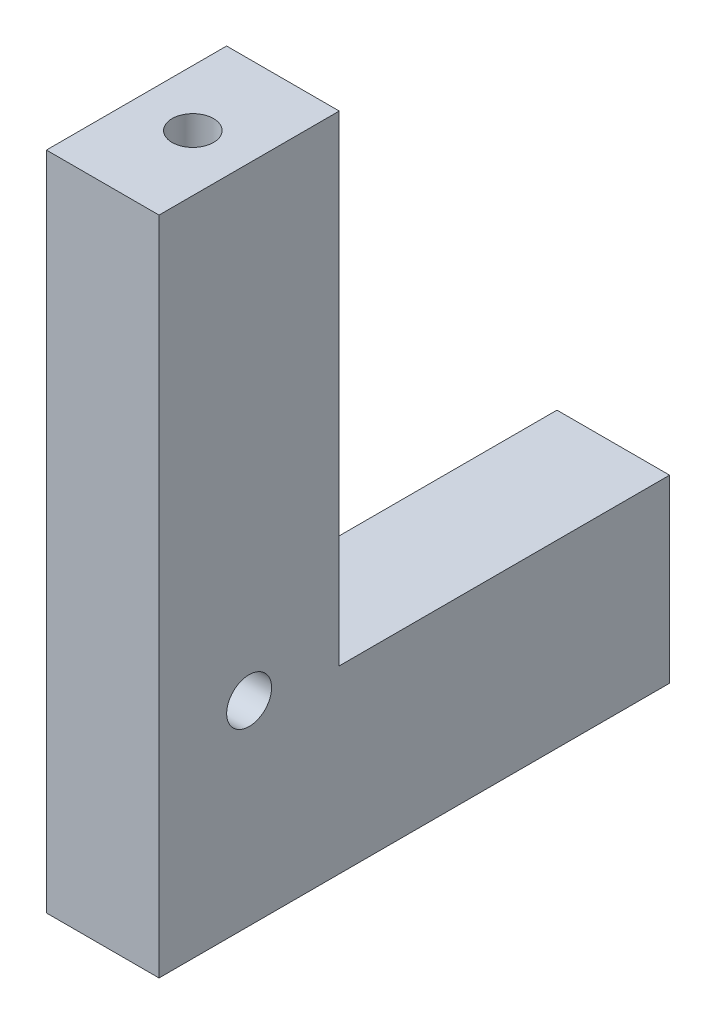
ISO-10303-21;
HEADER;
FILE_DESCRIPTION(('STEP AP214'),'2;1');
FILE_NAME('part.step','',(''),(''),'','','');
FILE_SCHEMA(('AUTOMOTIVE_DESIGN { 1 0 10303 214 1 1 1 1 }'));
ENDSEC;
DATA;
#1=APPLICATION_CONTEXT('core data for automotive mechanical design processes');
#2=APPLICATION_PROTOCOL_DEFINITION('international standard','automotive_design',2000,#1);
#3=PRODUCT_CONTEXT('',#1,'mechanical');
#4=PRODUCT('Part','Part','',(#3));
#5=PRODUCT_RELATED_PRODUCT_CATEGORY('part','',(#4));
#6=PRODUCT_DEFINITION_FORMATION('','',#4);
#7=PRODUCT_DEFINITION_CONTEXT('part definition',#1,'design');
#8=PRODUCT_DEFINITION('design','',#6,#7);
#9=PRODUCT_DEFINITION_SHAPE('','',#8);
#10=(LENGTH_UNIT() NAMED_UNIT(*) SI_UNIT(.MILLI.,.METRE.));
#11=(NAMED_UNIT(*) PLANE_ANGLE_UNIT() SI_UNIT($,.RADIAN.));
#12=(NAMED_UNIT(*) SI_UNIT($,.STERADIAN.) SOLID_ANGLE_UNIT());
#13=UNCERTAINTY_MEASURE_WITH_UNIT(LENGTH_MEASURE(1.E-05),#10,'distance_accuracy_value','');
#14=(GEOMETRIC_REPRESENTATION_CONTEXT(3) GLOBAL_UNCERTAINTY_ASSIGNED_CONTEXT((#13)) GLOBAL_UNIT_ASSIGNED_CONTEXT((#10,
#11,#12)) REPRESENTATION_CONTEXT('',''));
#15=CARTESIAN_POINT('',(0.,0.,0.));
#16=DIRECTION('',(0.,0.,1.));
#17=DIRECTION('',(1.,0.,0.));
#18=AXIS2_PLACEMENT_3D('',#15,#16,#17);
#19=CARTESIAN_POINT('',(0.,0.,0.));
#20=DIRECTION('',(0.,0.,1.));
#21=DIRECTION('',(1.,0.,0.));
#22=AXIS2_PLACEMENT_3D('',#19,#20,#21);
#23=PLANE('',#22);
#24=DIRECTION('',(0.,1.,0.));
#25=VECTOR('',#24,1.);
#26=CARTESIAN_POINT('',(0.,0.,0.));
#27=LINE('',#26,#25);
#28=CARTESIAN_POINT('',(0.,0.,0.));
#29=VERTEX_POINT('',#28);
#30=CARTESIAN_POINT('',(0.,15.24,0.));
#31=VERTEX_POINT('',#30);
#32=EDGE_CURVE('E91',#29,#31,#27,.T.);
#33=ORIENTED_EDGE('',*,*,#32,.F.);
#34=DIRECTION('',(1.,0.,0.));
#35=VECTOR('',#34,1.);
#36=CARTESIAN_POINT('',(0.,0.,0.));
#37=LINE('',#36,#35);
#38=CARTESIAN_POINT('',(-9.525,0.,0.));
#39=VERTEX_POINT('',#38);
#40=EDGE_CURVE('E76',#39,#29,#37,.T.);
#41=ORIENTED_EDGE('',*,*,#40,.F.);
#42=DIRECTION('',(0.,-1.,0.));
#43=VECTOR('',#42,1.);
#44=CARTESIAN_POINT('',(-9.525,0.,0.));
#45=LINE('',#44,#43);
#46=CARTESIAN_POINT('',(-9.525,15.24,0.));
#47=VERTEX_POINT('',#46);
#48=EDGE_CURVE('E87',#47,#39,#45,.T.);
#49=ORIENTED_EDGE('',*,*,#48,.F.);
#50=DIRECTION('',(-1.,0.,0.));
#51=VECTOR('',#50,1.);
#52=CARTESIAN_POINT('',(0.,15.24,0.));
#53=LINE('',#52,#51);
#54=EDGE_CURVE('E97',#31,#47,#53,.T.);
#55=ORIENTED_EDGE('',*,*,#54,.F.);
#56=EDGE_LOOP('',(#33,#41,#49,#55));
#57=FACE_BOUND('',#56,.T.);
#58=CARTESIAN_POINT('',(-4.7625,3.81,0.));
#59=DIRECTION('',(0.,0.,-1.));
#60=DIRECTION('',(-1.,0.,0.));
#61=AXIS2_PLACEMENT_3D('',#58,#59,#60);
#62=CIRCLE('',#61,1.7526);
#63=CARTESIAN_POINT('',(-6.5151,3.81,0.));
#64=VERTEX_POINT('',#63);
#65=EDGE_CURVE('E116',#64,#64,#62,.T.);
#66=ORIENTED_EDGE('',*,*,#65,.F.);
#67=EDGE_LOOP('',(#66));
#68=FACE_BOUND('',#67,.T.);
#69=CARTESIAN_POINT('',(-4.7625,11.43,0.));
#70=DIRECTION('',(0.,0.,-1.));
#71=DIRECTION('',(-1.,0.,0.));
#72=AXIS2_PLACEMENT_3D('',#69,#70,#71);
#73=CIRCLE('',#72,1.7526);
#74=CARTESIAN_POINT('',(-6.5151,11.43,0.));
#75=VERTEX_POINT('',#74);
#76=EDGE_CURVE('E163',#75,#75,#73,.T.);
#77=ORIENTED_EDGE('',*,*,#76,.F.);
#78=EDGE_LOOP('',(#77));
#79=FACE_BOUND('',#78,.T.);
#80=ADVANCED_FACE('F33',(#57,#68,#79),#23,.F.);
#81=CARTESIAN_POINT('',(0.,15.24,43.18));
#82=DIRECTION('',(0.,-1.,0.));
#83=DIRECTION('',(1.,0.,0.));
#84=AXIS2_PLACEMENT_3D('',#81,#82,#83);
#85=PLANE('',#84);
#86=DIRECTION('',(-1.,0.,0.));
#87=VECTOR('',#86,1.);
#88=CARTESIAN_POINT('',(-9.525,15.24,27.94));
#89=LINE('',#88,#87);
#90=CARTESIAN_POINT('',(0.,15.24,27.94));
#91=VERTEX_POINT('',#90);
#92=CARTESIAN_POINT('',(-9.525,15.24,27.94));
#93=VERTEX_POINT('',#92);
#94=EDGE_CURVE('E49',#91,#93,#89,.T.);
#95=ORIENTED_EDGE('',*,*,#94,.F.);
#96=DIRECTION('',(0.,0.,-1.));
#97=VECTOR('',#96,1.);
#98=CARTESIAN_POINT('',(0.,15.24,43.18));
#99=LINE('',#98,#97);
#100=EDGE_CURVE('E11',#91,#31,#99,.T.);
#101=ORIENTED_EDGE('',*,*,#100,.T.);
#102=ORIENTED_EDGE('',*,*,#54,.T.);
#103=DIRECTION('',(0.,0.,-1.));
#104=VECTOR('',#103,1.);
#105=CARTESIAN_POINT('',(-9.525,15.24,43.18));
#106=LINE('',#105,#104);
#107=EDGE_CURVE('E42',#93,#47,#106,.T.);
#108=ORIENTED_EDGE('',*,*,#107,.F.);
#109=EDGE_LOOP('',(#95,#101,#102,#108));
#110=FACE_BOUND('',#109,.T.);
#111=ADVANCED_FACE('F137',(#110),#85,.F.);
#112=CARTESIAN_POINT('',(0.,0.,43.18));
#113=DIRECTION('',(-1.,0.,0.));
#114=DIRECTION('',(0.,-1.,0.));
#115=AXIS2_PLACEMENT_3D('',#112,#113,#114);
#116=PLANE('',#115);
#117=CARTESIAN_POINT('',(0.,16.51,35.56));
#118=DIRECTION('',(1.,0.,0.));
#119=DIRECTION('',(0.,0.,-1.));
#120=AXIS2_PLACEMENT_3D('',#117,#118,#119);
#121=CIRCLE('',#120,1.89865);
#122=CARTESIAN_POINT('',(0.,16.51,33.66135));
#123=VERTEX_POINT('',#122);
#124=EDGE_CURVE('E178',#123,#123,#121,.T.);
#125=ORIENTED_EDGE('',*,*,#124,.F.);
#126=EDGE_LOOP('',(#125));
#127=FACE_BOUND('',#126,.T.);
#128=ORIENTED_EDGE('',*,*,#32,.T.);
#129=ORIENTED_EDGE('',*,*,#100,.F.);
#130=DIRECTION('',(0.,-1.,0.));
#131=VECTOR('',#130,1.);
#132=CARTESIAN_POINT('',(0.,55.88,27.94));
#133=LINE('',#132,#131);
#134=CARTESIAN_POINT('',(0.,55.88,27.94));
#135=VERTEX_POINT('',#134);
#136=EDGE_CURVE('E98',#135,#91,#133,.T.);
#137=ORIENTED_EDGE('',*,*,#136,.F.);
#138=DIRECTION('',(0.,0.,-1.));
#139=VECTOR('',#138,1.);
#140=CARTESIAN_POINT('',(0.,55.88,43.18));
#141=LINE('',#140,#139);
#142=CARTESIAN_POINT('',(0.,55.88,43.18));
#143=VERTEX_POINT('',#142);
#144=EDGE_CURVE('E148',#143,#135,#141,.T.);
#145=ORIENTED_EDGE('',*,*,#144,.F.);
#146=DIRECTION('',(0.,1.,0.));
#147=VECTOR('',#146,1.);
#148=CARTESIAN_POINT('',(0.,0.,43.18));
#149=LINE('',#148,#147);
#150=CARTESIAN_POINT('',(0.,0.,43.18));
#151=VERTEX_POINT('',#150);
#152=EDGE_CURVE('E86',#151,#143,#149,.T.);
#153=ORIENTED_EDGE('',*,*,#152,.F.);
#154=DIRECTION('',(0.,0.,-1.));
#155=VECTOR('',#154,1.);
#156=CARTESIAN_POINT('',(0.,0.,43.18));
#157=LINE('',#156,#155);
#158=EDGE_CURVE('E79',#151,#29,#157,.T.);
#159=ORIENTED_EDGE('',*,*,#158,.T.);
#160=EDGE_LOOP('',(#128,#129,#137,#145,#153,#159));
#161=FACE_BOUND('',#160,.T.);
#162=ADVANCED_FACE('F35',(#127,#161),#116,.F.);
#163=CARTESIAN_POINT('',(-9.525,0.,43.18));
#164=DIRECTION('',(1.,0.,0.));
#165=DIRECTION('',(0.,0.,-1.));
#166=AXIS2_PLACEMENT_3D('',#163,#164,#165);
#167=PLANE('',#166);
#168=CARTESIAN_POINT('',(-9.525,16.51,35.56));
#169=DIRECTION('',(1.,0.,0.));
#170=DIRECTION('',(0.,0.,-1.));
#171=AXIS2_PLACEMENT_3D('',#168,#169,#170);
#172=CIRCLE('',#171,1.89865);
#173=CARTESIAN_POINT('',(-9.525,16.51,33.66135));
#174=VERTEX_POINT('',#173);
#175=EDGE_CURVE('E175',#174,#174,#172,.T.);
#176=ORIENTED_EDGE('',*,*,#175,.T.);
#177=EDGE_LOOP('',(#176));
#178=FACE_BOUND('',#177,.T.);
#179=ORIENTED_EDGE('',*,*,#48,.T.);
#180=DIRECTION('',(0.,0.,-1.));
#181=VECTOR('',#180,1.);
#182=CARTESIAN_POINT('',(-9.525,0.,43.18));
#183=LINE('',#182,#181);
#184=CARTESIAN_POINT('',(-9.525,0.,43.18));
#185=VERTEX_POINT('',#184);
#186=EDGE_CURVE('E82',#185,#39,#183,.T.);
#187=ORIENTED_EDGE('',*,*,#186,.F.);
#188=DIRECTION('',(0.,-1.,0.));
#189=VECTOR('',#188,1.);
#190=CARTESIAN_POINT('',(-9.525,0.,43.18));
#191=LINE('',#190,#189);
#192=CARTESIAN_POINT('',(-9.52500000000006,55.88,43.18));
#193=VERTEX_POINT('',#192);
#194=EDGE_CURVE('E123',#193,#185,#191,.T.);
#195=ORIENTED_EDGE('',*,*,#194,.F.);
#196=DIRECTION('',(0.,0.,1.));
#197=VECTOR('',#196,1.);
#198=CARTESIAN_POINT('',(-9.52500000000006,55.88,43.18));
#199=LINE('',#198,#197);
#200=CARTESIAN_POINT('',(-9.52500000000006,55.88,27.94));
#201=VERTEX_POINT('',#200);
#202=EDGE_CURVE('E115',#201,#193,#199,.T.);
#203=ORIENTED_EDGE('',*,*,#202,.F.);
#204=DIRECTION('',(0.,-1.,0.));
#205=VECTOR('',#204,1.);
#206=CARTESIAN_POINT('',(-9.52500000000006,55.88,27.94));
#207=LINE('',#206,#205);
#208=EDGE_CURVE('E102',#201,#93,#207,.T.);
#209=ORIENTED_EDGE('',*,*,#208,.T.);
#210=ORIENTED_EDGE('',*,*,#107,.T.);
#211=EDGE_LOOP('',(#179,#187,#195,#203,#209,#210));
#212=FACE_BOUND('',#211,.T.);
#213=ADVANCED_FACE('F133',(#178,#212),#167,.F.);
#214=CARTESIAN_POINT('',(0.,0.,43.18));
#215=DIRECTION('',(0.,1.,0.));
#216=DIRECTION('',(-1.,0.,0.));
#217=AXIS2_PLACEMENT_3D('',#214,#215,#216);
#218=PLANE('',#217);
#219=ORIENTED_EDGE('',*,*,#40,.T.);
#220=ORIENTED_EDGE('',*,*,#158,.F.);
#221=DIRECTION('',(1.,0.,0.));
#222=VECTOR('',#221,1.);
#223=CARTESIAN_POINT('',(0.,0.,43.18));
#224=LINE('',#223,#222);
#225=EDGE_CURVE('E58',#185,#151,#224,.T.);
#226=ORIENTED_EDGE('',*,*,#225,.F.);
#227=ORIENTED_EDGE('',*,*,#186,.T.);
#228=EDGE_LOOP('',(#219,#220,#226,#227));
#229=FACE_BOUND('',#228,.T.);
#230=ADVANCED_FACE('F78',(#229),#218,.F.);
#231=CARTESIAN_POINT('',(0.,0.,43.18));
#232=DIRECTION('',(0.,0.,1.));
#233=DIRECTION('',(1.,0.,0.));
#234=AXIS2_PLACEMENT_3D('',#231,#232,#233);
#235=PLANE('',#234);
#236=ORIENTED_EDGE('',*,*,#152,.T.);
#237=DIRECTION('',(1.,0.,0.));
#238=VECTOR('',#237,1.);
#239=CARTESIAN_POINT('',(-9.52500000000006,55.88,43.18));
#240=LINE('',#239,#238);
#241=EDGE_CURVE('E129',#193,#143,#240,.T.);
#242=ORIENTED_EDGE('',*,*,#241,.F.);
#243=ORIENTED_EDGE('',*,*,#194,.T.);
#244=ORIENTED_EDGE('',*,*,#225,.T.);
#245=EDGE_LOOP('',(#236,#242,#243,#244));
#246=FACE_BOUND('',#245,.T.);
#247=ADVANCED_FACE('F126',(#246),#235,.T.);
#248=CARTESIAN_POINT('',(-9.52500000000006,55.88,27.94));
#249=DIRECTION('',(0.,0.,1.));
#250=DIRECTION('',(1.,0.,0.));
#251=AXIS2_PLACEMENT_3D('',#248,#249,#250);
#252=PLANE('',#251);
#253=ORIENTED_EDGE('',*,*,#94,.T.);
#254=ORIENTED_EDGE('',*,*,#208,.F.);
#255=DIRECTION('',(-1.,0.,0.));
#256=VECTOR('',#255,1.);
#257=CARTESIAN_POINT('',(-9.52500000000006,55.88,27.94));
#258=LINE('',#257,#256);
#259=EDGE_CURVE('E121',#135,#201,#258,.T.);
#260=ORIENTED_EDGE('',*,*,#259,.F.);
#261=ORIENTED_EDGE('',*,*,#136,.T.);
#262=EDGE_LOOP('',(#253,#254,#260,#261));
#263=FACE_BOUND('',#262,.T.);
#264=ADVANCED_FACE('F142',(#263),#252,.F.);
#265=CARTESIAN_POINT('',(-9.52500000000006,55.88,27.94));
#266=DIRECTION('',(0.,-1.,0.));
#267=DIRECTION('',(1.,0.,0.));
#268=AXIS2_PLACEMENT_3D('',#265,#266,#267);
#269=PLANE('',#268);
#270=CARTESIAN_POINT('',(-4.76250000000006,55.88,35.56));
#271=DIRECTION('',(0.,1.,0.));
#272=DIRECTION('',(0.,0.,1.));
#273=AXIS2_PLACEMENT_3D('',#270,#271,#272);
#274=CIRCLE('',#273,1.7526);
#275=CARTESIAN_POINT('',(-4.76250000000006,55.88,37.3126));
#276=VERTEX_POINT('',#275);
#277=EDGE_CURVE('E181',#276,#276,#274,.T.);
#278=ORIENTED_EDGE('',*,*,#277,.F.);
#279=EDGE_LOOP('',(#278));
#280=FACE_BOUND('',#279,.T.);
#281=ORIENTED_EDGE('',*,*,#202,.T.);
#282=ORIENTED_EDGE('',*,*,#241,.T.);
#283=ORIENTED_EDGE('',*,*,#144,.T.);
#284=ORIENTED_EDGE('',*,*,#259,.T.);
#285=EDGE_LOOP('',(#281,#282,#283,#284));
#286=FACE_BOUND('',#285,.T.);
#287=ADVANCED_FACE('F215',(#280,#286),#269,.F.);
#288=CARTESIAN_POINT('',(-4.7625,3.81,0.));
#289=DIRECTION('',(0.,0.,-1.));
#290=DIRECTION('',(-1.,0.,0.));
#291=AXIS2_PLACEMENT_3D('',#288,#289,#290);
#292=CYLINDRICAL_SURFACE('',#291,1.7526);
#293=CARTESIAN_POINT('',(-4.7625,3.81,9.906));
#294=DIRECTION('',(0.,0.,-1.));
#295=DIRECTION('',(-1.,0.,0.));
#296=AXIS2_PLACEMENT_3D('',#293,#294,#295);
#297=CIRCLE('',#296,1.7526);
#298=CARTESIAN_POINT('',(-6.5151,3.81,9.906));
#299=VERTEX_POINT('',#298);
#300=EDGE_CURVE('E154',#299,#299,#297,.T.);
#301=ORIENTED_EDGE('',*,*,#300,.F.);
#302=EDGE_LOOP('',(#301));
#303=FACE_BOUND('',#302,.T.);
#304=ORIENTED_EDGE('',*,*,#65,.T.);
#305=EDGE_LOOP('',(#304));
#306=FACE_BOUND('',#305,.T.);
#307=ADVANCED_FACE('F217',(#303,#306),#292,.F.);
#308=CARTESIAN_POINT('',(-3.40995000000001,3.81,9.906));
#309=DIRECTION('',(0.,0.,1.));
#310=DIRECTION('',(1.,0.,0.));
#311=AXIS2_PLACEMENT_3D('',#308,#309,#310);
#312=PLANE('',#311);
#313=CARTESIAN_POINT('',(-4.7625,3.81,9.906));
#314=DIRECTION('',(0.,0.,-1.));
#315=DIRECTION('',(-1.,0.,0.));
#316=AXIS2_PLACEMENT_3D('',#313,#314,#315);
#317=CIRCLE('',#316,1.35255);
#318=CARTESIAN_POINT('',(-6.11505,3.81,9.906));
#319=VERTEX_POINT('',#318);
#320=EDGE_CURVE('E157',#319,#319,#317,.T.);
#321=ORIENTED_EDGE('',*,*,#320,.F.);
#322=EDGE_LOOP('',(#321));
#323=FACE_BOUND('',#322,.T.);
#324=ORIENTED_EDGE('',*,*,#300,.T.);
#325=EDGE_LOOP('',(#324));
#326=FACE_BOUND('',#325,.T.);
#327=ADVANCED_FACE('F283',(#323,#326),#312,.F.);
#328=CARTESIAN_POINT('',(-4.7625,3.81,0.));
#329=DIRECTION('',(0.,0.,-1.));
#330=DIRECTION('',(-1.,0.,0.));
#331=AXIS2_PLACEMENT_3D('',#328,#329,#330);
#332=CYLINDRICAL_SURFACE('',#331,1.35255);
#333=CARTESIAN_POINT('',(-4.7625,3.81,13.97));
#334=DIRECTION('',(0.,0.,-1.));
#335=DIRECTION('',(-1.,0.,0.));
#336=AXIS2_PLACEMENT_3D('',#333,#334,#335);
#337=CIRCLE('',#336,1.35255);
#338=CARTESIAN_POINT('',(-6.11505,3.81,13.97));
#339=VERTEX_POINT('',#338);
#340=EDGE_CURVE('E160',#339,#339,#337,.T.);
#341=ORIENTED_EDGE('',*,*,#340,.F.);
#342=EDGE_LOOP('',(#341));
#343=FACE_BOUND('',#342,.T.);
#344=ORIENTED_EDGE('',*,*,#320,.T.);
#345=EDGE_LOOP('',(#344));
#346=FACE_BOUND('',#345,.T.);
#347=ADVANCED_FACE('F280',(#343,#346),#332,.F.);
#348=CARTESIAN_POINT('',(-4.7625,3.81,13.97));
#349=DIRECTION('',(0.,0.,-1.));
#350=DIRECTION('',(-1.,0.,0.));
#351=AXIS2_PLACEMENT_3D('',#348,#349,#350);
#352=CONICAL_SURFACE('',#351,1.35255,1.02974425867665);
#353=CARTESIAN_POINT('',(-4.76250000000001,3.81,14.7826940302657));
#354=VERTEX_POINT('',#353);
#355=VERTEX_LOOP('',#354);
#356=FACE_BOUND('',#355,.T.);
#357=ORIENTED_EDGE('',*,*,#340,.T.);
#358=EDGE_LOOP('',(#357));
#359=FACE_BOUND('',#358,.T.);
#360=ADVANCED_FACE('F276',(#356,#359),#352,.F.);
#361=CARTESIAN_POINT('',(-4.7625,11.43,0.));
#362=DIRECTION('',(0.,0.,-1.));
#363=DIRECTION('',(-1.,0.,0.));
#364=AXIS2_PLACEMENT_3D('',#361,#362,#363);
#365=CYLINDRICAL_SURFACE('',#364,1.7526);
#366=CARTESIAN_POINT('',(-4.7625,11.43,9.906));
#367=DIRECTION('',(0.,0.,-1.));
#368=DIRECTION('',(-1.,0.,0.));
#369=AXIS2_PLACEMENT_3D('',#366,#367,#368);
#370=CIRCLE('',#369,1.7526);
#371=CARTESIAN_POINT('',(-6.5151,11.43,9.906));
#372=VERTEX_POINT('',#371);
#373=EDGE_CURVE('E166',#372,#372,#370,.T.);
#374=ORIENTED_EDGE('',*,*,#373,.F.);
#375=EDGE_LOOP('',(#374));
#376=FACE_BOUND('',#375,.T.);
#377=ORIENTED_EDGE('',*,*,#76,.T.);
#378=EDGE_LOOP('',(#377));
#379=FACE_BOUND('',#378,.T.);
#380=ADVANCED_FACE('F272',(#376,#379),#365,.F.);
#381=CARTESIAN_POINT('',(-3.40995000000001,11.43,9.906));
#382=DIRECTION('',(0.,0.,1.));
#383=DIRECTION('',(1.,0.,0.));
#384=AXIS2_PLACEMENT_3D('',#381,#382,#383);
#385=PLANE('',#384);
#386=CARTESIAN_POINT('',(-4.7625,11.43,9.906));
#387=DIRECTION('',(0.,0.,-1.));
#388=DIRECTION('',(-1.,0.,0.));
#389=AXIS2_PLACEMENT_3D('',#386,#387,#388);
#390=CIRCLE('',#389,1.35255);
#391=CARTESIAN_POINT('',(-6.11505,11.43,9.906));
#392=VERTEX_POINT('',#391);
#393=EDGE_CURVE('E169',#392,#392,#390,.T.);
#394=ORIENTED_EDGE('',*,*,#393,.F.);
#395=EDGE_LOOP('',(#394));
#396=FACE_BOUND('',#395,.T.);
#397=ORIENTED_EDGE('',*,*,#373,.T.);
#398=EDGE_LOOP('',(#397));
#399=FACE_BOUND('',#398,.T.);
#400=ADVANCED_FACE('F268',(#396,#399),#385,.F.);
#401=CARTESIAN_POINT('',(-4.7625,11.43,0.));
#402=DIRECTION('',(0.,0.,-1.));
#403=DIRECTION('',(-1.,0.,0.));
#404=AXIS2_PLACEMENT_3D('',#401,#402,#403);
#405=CYLINDRICAL_SURFACE('',#404,1.35255);
#406=CARTESIAN_POINT('',(-4.7625,11.43,13.97));
#407=DIRECTION('',(0.,0.,-1.));
#408=DIRECTION('',(-1.,0.,0.));
#409=AXIS2_PLACEMENT_3D('',#406,#407,#408);
#410=CIRCLE('',#409,1.35255);
#411=CARTESIAN_POINT('',(-6.11505,11.43,13.97));
#412=VERTEX_POINT('',#411);
#413=EDGE_CURVE('E172',#412,#412,#410,.T.);
#414=ORIENTED_EDGE('',*,*,#413,.F.);
#415=EDGE_LOOP('',(#414));
#416=FACE_BOUND('',#415,.T.);
#417=ORIENTED_EDGE('',*,*,#393,.T.);
#418=EDGE_LOOP('',(#417));
#419=FACE_BOUND('',#418,.T.);
#420=ADVANCED_FACE('F262',(#416,#419),#405,.F.);
#421=CARTESIAN_POINT('',(-4.7625,11.43,13.97));
#422=DIRECTION('',(0.,0.,-1.));
#423=DIRECTION('',(-1.,0.,0.));
#424=AXIS2_PLACEMENT_3D('',#421,#422,#423);
#425=CONICAL_SURFACE('',#424,1.35255,1.02974425867665);
#426=CARTESIAN_POINT('',(-4.76250000000001,11.43,14.7826940302657));
#427=VERTEX_POINT('',#426);
#428=VERTEX_LOOP('',#427);
#429=FACE_BOUND('',#428,.T.);
#430=ORIENTED_EDGE('',*,*,#413,.T.);
#431=EDGE_LOOP('',(#430));
#432=FACE_BOUND('',#431,.T.);
#433=ADVANCED_FACE('F256',(#429,#432),#425,.F.);
#434=CARTESIAN_POINT('',(0.,16.51,35.56));
#435=DIRECTION('',(1.,0.,0.));
#436=DIRECTION('',(0.,0.,-1.));
#437=AXIS2_PLACEMENT_3D('',#434,#435,#436);
#438=CYLINDRICAL_SURFACE('',#437,1.89865);
#439=ORIENTED_EDGE('',*,*,#124,.T.);
#440=EDGE_LOOP('',(#439));
#441=FACE_BOUND('',#440,.T.);
#442=ORIENTED_EDGE('',*,*,#175,.F.);
#443=EDGE_LOOP('',(#442));
#444=FACE_BOUND('',#443,.T.);
#445=ADVANCED_FACE('F211',(#441,#444),#438,.F.);
#446=CARTESIAN_POINT('',(-4.76250000000006,55.88,35.56));
#447=DIRECTION('',(0.,1.,0.));
#448=DIRECTION('',(0.,0.,1.));
#449=AXIS2_PLACEMENT_3D('',#446,#447,#448);
#450=CYLINDRICAL_SURFACE('',#449,1.7526);
#451=CARTESIAN_POINT('',(-4.76250000000006,45.974,35.56));
#452=DIRECTION('',(0.,1.,0.));
#453=DIRECTION('',(0.,0.,1.));
#454=AXIS2_PLACEMENT_3D('',#451,#452,#453);
#455=CIRCLE('',#454,1.7526);
#456=CARTESIAN_POINT('',(-4.76250000000006,45.974,37.3126));
#457=VERTEX_POINT('',#456);
#458=EDGE_CURVE('E184',#457,#457,#455,.T.);
#459=ORIENTED_EDGE('',*,*,#458,.F.);
#460=EDGE_LOOP('',(#459));
#461=FACE_BOUND('',#460,.T.);
#462=ORIENTED_EDGE('',*,*,#277,.T.);
#463=EDGE_LOOP('',(#462));
#464=FACE_BOUND('',#463,.T.);
#465=ADVANCED_FACE('F205',(#461,#464),#450,.F.);
#466=CARTESIAN_POINT('',(-3.40995000000006,45.974,35.56));
#467=DIRECTION('',(0.,-1.,0.));
#468=DIRECTION('',(0.,0.,-1.));
#469=AXIS2_PLACEMENT_3D('',#466,#467,#468);
#470=PLANE('',#469);
#471=CARTESIAN_POINT('',(-4.76250000000006,45.974,35.56));
#472=DIRECTION('',(0.,1.,0.));
#473=DIRECTION('',(0.,0.,1.));
#474=AXIS2_PLACEMENT_3D('',#471,#472,#473);
#475=CIRCLE('',#474,1.35255);
#476=CARTESIAN_POINT('',(-4.76250000000006,45.974,36.91255));
#477=VERTEX_POINT('',#476);
#478=EDGE_CURVE('E187',#477,#477,#475,.T.);
#479=ORIENTED_EDGE('',*,*,#478,.F.);
#480=EDGE_LOOP('',(#479));
#481=FACE_BOUND('',#480,.T.);
#482=ORIENTED_EDGE('',*,*,#458,.T.);
#483=EDGE_LOOP('',(#482));
#484=FACE_BOUND('',#483,.T.);
#485=ADVANCED_FACE('F199',(#481,#484),#470,.F.);
#486=CARTESIAN_POINT('',(-4.76250000000006,55.88,35.56));
#487=DIRECTION('',(0.,1.,0.));
#488=DIRECTION('',(0.,0.,1.));
#489=AXIS2_PLACEMENT_3D('',#486,#487,#488);
#490=CYLINDRICAL_SURFACE('',#489,1.35255);
#491=CARTESIAN_POINT('',(-4.76250000000006,41.91,35.56));
#492=DIRECTION('',(0.,1.,0.));
#493=DIRECTION('',(0.,0.,1.));
#494=AXIS2_PLACEMENT_3D('',#491,#492,#493);
#495=CIRCLE('',#494,1.35255);
#496=CARTESIAN_POINT('',(-4.76250000000006,41.91,36.91255));
#497=VERTEX_POINT('',#496);
#498=EDGE_CURVE('E190',#497,#497,#495,.T.);
#499=ORIENTED_EDGE('',*,*,#498,.F.);
#500=EDGE_LOOP('',(#499));
#501=FACE_BOUND('',#500,.T.);
#502=ORIENTED_EDGE('',*,*,#478,.T.);
#503=EDGE_LOOP('',(#502));
#504=FACE_BOUND('',#503,.T.);
#505=ADVANCED_FACE('F196',(#501,#504),#490,.F.);
#506=CARTESIAN_POINT('',(-4.76250000000006,41.91,35.56));
#507=DIRECTION('',(0.,1.,0.));
#508=DIRECTION('',(0.,0.,1.));
#509=AXIS2_PLACEMENT_3D('',#506,#507,#508);
#510=CONICAL_SURFACE('',#509,1.35255,1.02974425867665);
#511=CARTESIAN_POINT('',(-4.76250000000006,41.0973059697343,35.56));
#512=VERTEX_POINT('',#511);
#513=VERTEX_LOOP('',#512);
#514=FACE_BOUND('',#513,.T.);
#515=ORIENTED_EDGE('',*,*,#498,.T.);
#516=EDGE_LOOP('',(#515));
#517=FACE_BOUND('',#516,.T.);
#518=ADVANCED_FACE('F194',(#514,#517),#510,.F.);
#519=CLOSED_SHELL('',(#80,#111,#162,#213,#230,#247,#264,#287,#307,#327,#347,#360,#380,#400,#420,
#433,#445,#465,#485,#505,#518));
#520=MANIFOLD_SOLID_BREP('B2',#519);
#521=ADVANCED_BREP_SHAPE_REPRESENTATION('',(#18,#520),#14);
#522=SHAPE_DEFINITION_REPRESENTATION(#9,#521);
ENDSEC;
END-ISO-10303-21;
